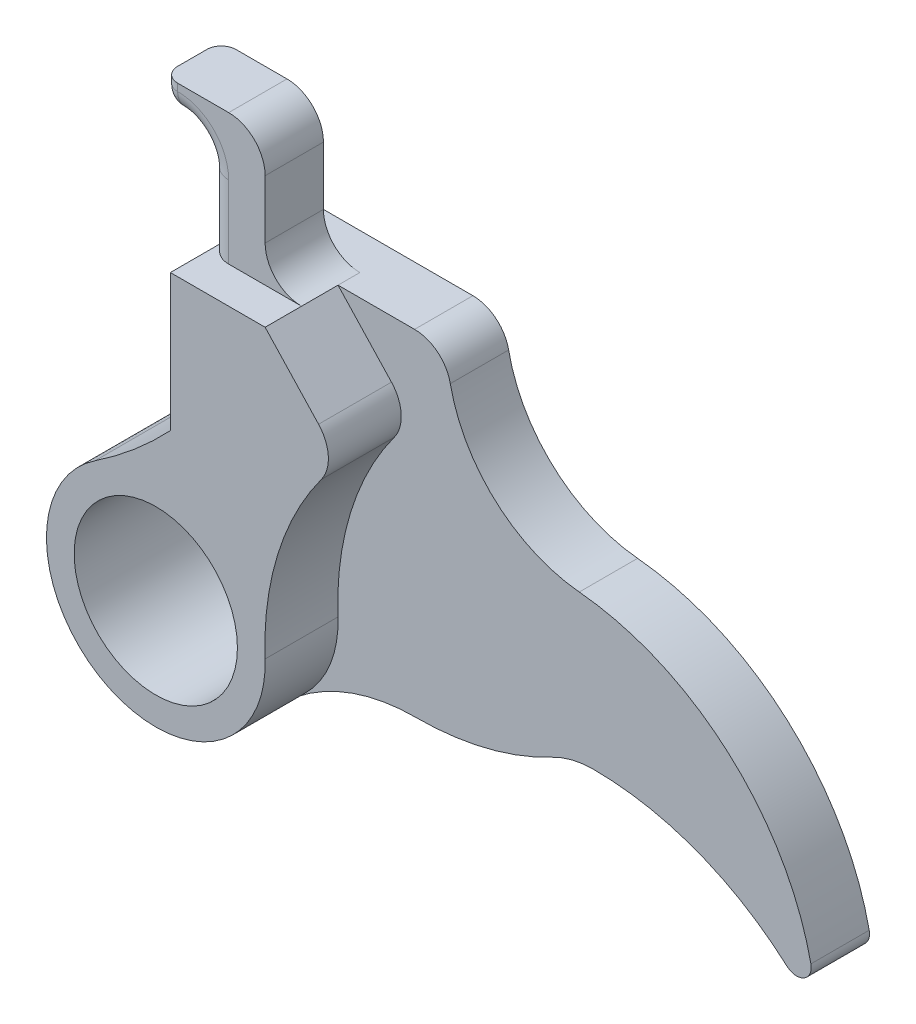
ISO-10303-21;
HEADER;
FILE_DESCRIPTION(('STEP AP214'),'2;1');
FILE_NAME('part.step','',(''),(''),'','','');
FILE_SCHEMA(('AUTOMOTIVE_DESIGN { 1 0 10303 214 1 1 1 1 }'));
ENDSEC;
DATA;
#1=APPLICATION_CONTEXT('core data for automotive mechanical design processes');
#2=APPLICATION_PROTOCOL_DEFINITION('international standard','automotive_design',2000,#1);
#3=PRODUCT_CONTEXT('',#1,'mechanical');
#4=PRODUCT('Part','Part','',(#3));
#5=PRODUCT_RELATED_PRODUCT_CATEGORY('part','',(#4));
#6=PRODUCT_DEFINITION_FORMATION('','',#4);
#7=PRODUCT_DEFINITION_CONTEXT('part definition',#1,'design');
#8=PRODUCT_DEFINITION('design','',#6,#7);
#9=PRODUCT_DEFINITION_SHAPE('','',#8);
#10=(LENGTH_UNIT() NAMED_UNIT(*) SI_UNIT(.MILLI.,.METRE.));
#11=(NAMED_UNIT(*) PLANE_ANGLE_UNIT() SI_UNIT($,.RADIAN.));
#12=(NAMED_UNIT(*) SI_UNIT($,.STERADIAN.) SOLID_ANGLE_UNIT());
#13=UNCERTAINTY_MEASURE_WITH_UNIT(LENGTH_MEASURE(1.E-05),#10,'distance_accuracy_value','');
#14=(GEOMETRIC_REPRESENTATION_CONTEXT(3) GLOBAL_UNCERTAINTY_ASSIGNED_CONTEXT((#13)) GLOBAL_UNIT_ASSIGNED_CONTEXT((#10,
#11,#12)) REPRESENTATION_CONTEXT('',''));
#15=CARTESIAN_POINT('',(0.,0.,0.));
#16=DIRECTION('',(0.,0.,1.));
#17=DIRECTION('',(1.,0.,0.));
#18=AXIS2_PLACEMENT_3D('',#15,#16,#17);
#19=CARTESIAN_POINT('',(0.,0.,9.));
#20=DIRECTION('',(0.,0.,1.));
#21=DIRECTION('',(1.,0.,0.));
#22=AXIS2_PLACEMENT_3D('',#19,#20,#21);
#23=PLANE('',#22);
#24=CARTESIAN_POINT('',(-25.,-20.,9.));
#25=DIRECTION('',(0.,0.,1.));
#26=DIRECTION('',(1.,0.,0.));
#27=AXIS2_PLACEMENT_3D('',#24,#25,#26);
#28=CIRCLE('',#27,5.6);
#29=CARTESIAN_POINT('',(-19.4,-20.,9.));
#30=VERTEX_POINT('',#29);
#31=EDGE_CURVE('E404',#30,#30,#28,.T.);
#32=ORIENTED_EDGE('',*,*,#31,.F.);
#33=EDGE_LOOP('',(#32));
#34=FACE_BOUND('',#33,.T.);
#35=CARTESIAN_POINT('',(2.47970711627112,-18.9437345011985,9.));
#36=DIRECTION('',(0.,0.,1.));
#37=DIRECTION('',(1.,0.,0.));
#38=AXIS2_PLACEMENT_3D('',#35,#36,#37);
#39=CIRCLE('',#38,20.);
#40=CARTESIAN_POINT('',(-13.6463406152361,-7.1136633027166,9.));
#41=VERTEX_POINT('',#40);
#42=CARTESIAN_POINT('',(-17.5055344228351,-19.711927591236,9.));
#43=VERTEX_POINT('',#42);
#44=EDGE_CURVE('E423',#41,#43,#39,.T.);
#45=ORIENTED_EDGE('',*,*,#44,.F.);
#46=CARTESIAN_POINT('',(-15.6620965816745,-5.63490440290636,9.));
#47=DIRECTION('',(0.,0.,1.));
#48=DIRECTION('',(1.,0.,0.));
#49=AXIS2_PLACEMENT_3D('',#46,#47,#48);
#50=CIRCLE('',#49,2.5);
#51=CARTESIAN_POINT('',(-13.8340809859854,-3.92951325073119,9.));
#52=VERTEX_POINT('',#51);
#53=EDGE_CURVE('E47',#41,#52,#50,.T.);
#54=ORIENTED_EDGE('',*,*,#53,.T.);
#55=DIRECTION('',(-0.682156460870068,0.731206238275648,0.));
#56=VECTOR('',#55,1.);
#57=CARTESIAN_POINT('',(-9.35659485063142,-8.72894854419405,9.));
#58=LINE('',#57,#56);
#59=CARTESIAN_POINT('',(-17.5,0.,9.));
#60=VERTEX_POINT('',#59);
#61=EDGE_CURVE('E236',#52,#60,#58,.T.);
#62=ORIENTED_EDGE('',*,*,#61,.T.);
#63=DIRECTION('',(1.,0.,0.));
#64=VECTOR('',#63,1.);
#65=CARTESIAN_POINT('',(0.,0.,9.));
#66=LINE('',#65,#64);
#67=CARTESIAN_POINT('',(-24.,0.,9.));
#68=VERTEX_POINT('',#67);
#69=EDGE_CURVE('E240',#68,#60,#66,.T.);
#70=ORIENTED_EDGE('',*,*,#69,.F.);
#71=DIRECTION('',(0.,1.,0.));
#72=VECTOR('',#71,1.);
#73=CARTESIAN_POINT('',(-24.,0.,9.));
#74=LINE('',#73,#72);
#75=CARTESIAN_POINT('',(-24.,-9.39099248921224,9.));
#76=VERTEX_POINT('',#75);
#77=EDGE_CURVE('E444',#76,#68,#74,.T.);
#78=ORIENTED_EDGE('',*,*,#77,.F.);
#79=CARTESIAN_POINT('',(-45.8407588151391,11.1755155852987,9.));
#80=DIRECTION('',(0.,0.,1.));
#81=DIRECTION('',(1.,0.,0.));
#82=AXIS2_PLACEMENT_3D('',#79,#80,#81);
#83=CIRCLE('',#82,30.);
#84=CARTESIAN_POINT('',(-29.1681517630278,-13.7648968829403,9.));
#85=VERTEX_POINT('',#84);
#86=EDGE_CURVE('E447',#85,#76,#83,.T.);
#87=ORIENTED_EDGE('',*,*,#86,.F.);
#88=CARTESIAN_POINT('',(-25.,-20.,9.));
#89=DIRECTION('',(0.,0.,1.));
#90=DIRECTION('',(1.,0.,0.));
#91=AXIS2_PLACEMENT_3D('',#88,#89,#90);
#92=CIRCLE('',#91,7.5);
#93=CARTESIAN_POINT('',(-20.3155700843968,-25.8571423378472,9.));
#94=VERTEX_POINT('',#93);
#95=EDGE_CURVE('E441',#85,#94,#92,.T.);
#96=ORIENTED_EDGE('',*,*,#95,.T.);
#97=CARTESIAN_POINT('',(-25.,-20.,9.));
#98=DIRECTION('',(0.,0.,1.));
#99=DIRECTION('',(1.,0.,0.));
#100=AXIS2_PLACEMENT_3D('',#97,#98,#99);
#101=CIRCLE('',#100,7.5);
#102=EDGE_CURVE('E276',#94,#43,#101,.T.);
#103=ORIENTED_EDGE('',*,*,#102,.T.);
#104=EDGE_LOOP('',(#45,#54,#62,#70,#78,#87,#96,#103));
#105=FACE_BOUND('',#104,.T.);
#106=ADVANCED_FACE('F39',(#34,#105),#23,.T.);
#107=CARTESIAN_POINT('',(2.47970711627112,-18.9437345011985,4.));
#108=DIRECTION('',(0.,0.,1.));
#109=DIRECTION('',(1.,0.,0.));
#110=AXIS2_PLACEMENT_3D('',#107,#108,#109);
#111=CYLINDRICAL_SURFACE('',#110,20.);
#112=CARTESIAN_POINT('',(2.47970711627112,-18.9437345011985,4.));
#113=DIRECTION('',(0.,0.,1.));
#114=DIRECTION('',(1.,0.,0.));
#115=AXIS2_PLACEMENT_3D('',#112,#113,#114);
#116=CIRCLE('',#115,20.);
#117=CARTESIAN_POINT('',(-13.6463406152361,-7.1136633027166,4.));
#118=VERTEX_POINT('',#117);
#119=CARTESIAN_POINT('',(-17.5055344228351,-19.711927591236,4.));
#120=VERTEX_POINT('',#119);
#121=EDGE_CURVE('E426',#118,#120,#116,.T.);
#122=ORIENTED_EDGE('',*,*,#121,.F.);
#123=DIRECTION('',(0.,0.,1.));
#124=VECTOR('',#123,1.);
#125=CARTESIAN_POINT('',(-13.6463406152361,-7.1136633027166,4.));
#126=LINE('',#125,#124);
#127=EDGE_CURVE('E54',#118,#41,#126,.T.);
#128=ORIENTED_EDGE('',*,*,#127,.T.);
#129=ORIENTED_EDGE('',*,*,#44,.T.);
#130=DIRECTION('',(0.,0.,1.));
#131=VECTOR('',#130,1.);
#132=CARTESIAN_POINT('',(-17.5055344228351,-19.711927591236,4.));
#133=LINE('',#132,#131);
#134=EDGE_CURVE('E279',#43,#120,#133,.F.);
#135=ORIENTED_EDGE('',*,*,#134,.T.);
#136=EDGE_LOOP('',(#122,#128,#129,#135));
#137=FACE_BOUND('',#136,.T.);
#138=ADVANCED_FACE('F550',(#137),#111,.F.);
#139=CARTESIAN_POINT('',(15.3208888623795,0.,0.));
#140=DIRECTION('',(0.,-1.,0.));
#141=DIRECTION('',(0.,0.,-1.));
#142=AXIS2_PLACEMENT_3D('',#139,#140,#141);
#143=PLANE('',#142);
#144=DIRECTION('',(0.,0.,-1.));
#145=VECTOR('',#144,1.);
#146=CARTESIAN_POINT('',(-17.5,0.,14.));
#147=LINE('',#146,#145);
#148=CARTESIAN_POINT('',(-17.5,0.,6.5));
#149=VERTEX_POINT('',#148);
#150=EDGE_CURVE('E246',#60,#149,#147,.T.);
#151=ORIENTED_EDGE('',*,*,#150,.T.);
#152=DIRECTION('',(-1.,0.,0.));
#153=VECTOR('',#152,1.);
#154=CARTESIAN_POINT('',(15.3208888623795,0.,6.5));
#155=LINE('',#154,#153);
#156=CARTESIAN_POINT('',(-22.5,0.,6.5));
#157=VERTEX_POINT('',#156);
#158=EDGE_CURVE('E417',#149,#157,#155,.T.);
#159=ORIENTED_EDGE('',*,*,#158,.T.);
#160=CARTESIAN_POINT('',(-22.5,0.,5.));
#161=DIRECTION('',(0.,-1.,0.));
#162=DIRECTION('',(0.,0.,-1.));
#163=AXIS2_PLACEMENT_3D('',#160,#161,#162);
#164=CIRCLE('',#163,1.5);
#165=CARTESIAN_POINT('',(-24.,0.,5.));
#166=VERTEX_POINT('',#165);
#167=EDGE_CURVE('E313',#157,#166,#164,.T.);
#168=ORIENTED_EDGE('',*,*,#167,.T.);
#169=DIRECTION('',(0.,0.,1.));
#170=VECTOR('',#169,1.);
#171=CARTESIAN_POINT('',(-24.,0.,9.));
#172=LINE('',#171,#170);
#173=EDGE_CURVE('E259',#166,#68,#172,.T.);
#174=ORIENTED_EDGE('',*,*,#173,.T.);
#175=ORIENTED_EDGE('',*,*,#69,.T.);
#176=EDGE_LOOP('',(#151,#159,#168,#174,#175));
#177=FACE_BOUND('',#176,.T.);
#178=ADVANCED_FACE('F257',(#177),#143,.F.);
#179=CARTESIAN_POINT('',(-12.1424843600049,-3.00956560725662,9.));
#180=DIRECTION('',(0.,0.,-1.));
#181=DIRECTION('',(-1.,0.,0.));
#182=AXIS2_PLACEMENT_3D('',#179,#180,#181);
#183=CYLINDRICAL_SURFACE('',#182,20.);
#184=DIRECTION('',(0.,0.,-1.));
#185=VECTOR('',#184,1.);
#186=CARTESIAN_POINT('',(-2.80211177538573,-20.6945151401361,9.));
#187=LINE('',#186,#185);
#188=CARTESIAN_POINT('',(-2.80211177538574,-20.6945151401361,4.));
#189=VERTEX_POINT('',#188);
#190=CARTESIAN_POINT('',(-2.80211177538573,-20.6945151401361,0.));
#191=VERTEX_POINT('',#190);
#192=EDGE_CURVE('E483',#189,#191,#187,.T.);
#193=ORIENTED_EDGE('',*,*,#192,.F.);
#194=CARTESIAN_POINT('',(-12.1424843600049,-3.00956560725662,4.));
#195=DIRECTION('',(0.,0.,1.));
#196=DIRECTION('',(1.,0.,0.));
#197=AXIS2_PLACEMENT_3D('',#194,#195,#196);
#198=CIRCLE('',#197,20.);
#199=CARTESIAN_POINT('',(-12.174852362437,-23.0095394150499,4.));
#200=VERTEX_POINT('',#199);
#201=EDGE_CURVE('E430',#200,#189,#198,.T.);
#202=ORIENTED_EDGE('',*,*,#201,.F.);
#203=DIRECTION('',(0.,0.,-1.));
#204=VECTOR('',#203,1.);
#205=CARTESIAN_POINT('',(-12.174852362437,-23.0095394150499,9.));
#206=LINE('',#205,#204);
#207=CARTESIAN_POINT('',(-12.174852362437,-23.0095394150499,0.));
#208=VERTEX_POINT('',#207);
#209=EDGE_CURVE('E485',#200,#208,#206,.T.);
#210=ORIENTED_EDGE('',*,*,#209,.T.);
#211=CARTESIAN_POINT('',(-12.1424843600049,-3.00956560725662,0.));
#212=DIRECTION('',(0.,0.,1.));
#213=DIRECTION('',(1.,0.,0.));
#214=AXIS2_PLACEMENT_3D('',#211,#212,#213);
#215=CIRCLE('',#214,20.);
#216=EDGE_CURVE('E456',#191,#208,#215,.F.);
#217=ORIENTED_EDGE('',*,*,#216,.F.);
#218=EDGE_LOOP('',(#193,#202,#210,#217));
#219=FACE_BOUND('',#218,.T.);
#220=ADVANCED_FACE('F546',(#219),#183,.T.);
#221=CARTESIAN_POINT('',(0.,-26.,9.));
#222=DIRECTION('',(0.,0.,-1.));
#223=DIRECTION('',(-1.,0.,0.));
#224=AXIS2_PLACEMENT_3D('',#221,#222,#223);
#225=CYLINDRICAL_SURFACE('',#224,6.);
#226=CARTESIAN_POINT('',(0.,-26.,4.));
#227=DIRECTION('',(0.,0.,-1.));
#228=DIRECTION('',(1.,0.,0.));
#229=AXIS2_PLACEMENT_3D('',#226,#227,#228);
#230=CIRCLE('',#229,6.);
#231=CARTESIAN_POINT('',(0.,-20.,4.));
#232=VERTEX_POINT('',#231);
#233=EDGE_CURVE('E432',#189,#232,#230,.T.);
#234=ORIENTED_EDGE('',*,*,#233,.F.);
#235=ORIENTED_EDGE('',*,*,#192,.T.);
#236=CARTESIAN_POINT('',(0.,-26.,0.));
#237=DIRECTION('',(0.,0.,1.));
#238=DIRECTION('',(1.,0.,0.));
#239=AXIS2_PLACEMENT_3D('',#236,#237,#238);
#240=CIRCLE('',#239,6.);
#241=CARTESIAN_POINT('',(0.,-20.,0.));
#242=VERTEX_POINT('',#241);
#243=EDGE_CURVE('E459',#191,#242,#240,.F.);
#244=ORIENTED_EDGE('',*,*,#243,.T.);
#245=DIRECTION('',(0.,0.,-1.));
#246=VECTOR('',#245,1.);
#247=CARTESIAN_POINT('',(0.,-20.,9.));
#248=LINE('',#247,#246);
#249=EDGE_CURVE('E480',#232,#242,#248,.T.);
#250=ORIENTED_EDGE('',*,*,#249,.F.);
#251=EDGE_LOOP('',(#234,#235,#244,#250));
#252=FACE_BOUND('',#251,.T.);
#253=ADVANCED_FACE('F543',(#252),#225,.F.);
#254=CARTESIAN_POINT('',(0.,-40.,9.));
#255=DIRECTION('',(0.,0.,-1.));
#256=DIRECTION('',(-1.,0.,0.));
#257=AXIS2_PLACEMENT_3D('',#254,#255,#256);
#258=CYLINDRICAL_SURFACE('',#257,20.);
#259=CARTESIAN_POINT('',(0.,-40.,0.));
#260=DIRECTION('',(0.,0.,1.));
#261=DIRECTION('',(1.,0.,0.));
#262=AXIS2_PLACEMENT_3D('',#259,#260,#261);
#263=CIRCLE('',#262,20.);
#264=CARTESIAN_POINT('',(13.2934445375952,-25.0572983592029,0.));
#265=VERTEX_POINT('',#264);
#266=EDGE_CURVE('E462',#265,#242,#263,.T.);
#267=ORIENTED_EDGE('',*,*,#266,.F.);
#268=DIRECTION('',(0.,0.,-1.));
#269=VECTOR('',#268,1.);
#270=CARTESIAN_POINT('',(13.2934445375952,-25.0572983592029,9.));
#271=LINE('',#270,#269);
#272=CARTESIAN_POINT('',(13.2934445375952,-25.0572983592029,4.));
#273=VERTEX_POINT('',#272);
#274=EDGE_CURVE('E272',#265,#273,#271,.F.);
#275=ORIENTED_EDGE('',*,*,#274,.T.);
#276=CARTESIAN_POINT('',(0.,-40.,4.));
#277=DIRECTION('',(0.,0.,-1.));
#278=DIRECTION('',(1.,0.,0.));
#279=AXIS2_PLACEMENT_3D('',#276,#277,#278);
#280=CIRCLE('',#279,20.);
#281=EDGE_CURVE('E434',#232,#273,#280,.T.);
#282=ORIENTED_EDGE('',*,*,#281,.F.);
#283=ORIENTED_EDGE('',*,*,#249,.T.);
#284=EDGE_LOOP('',(#267,#275,#282,#283));
#285=FACE_BOUND('',#284,.T.);
#286=ADVANCED_FACE('F536',(#285),#258,.F.);
#287=CARTESIAN_POINT('',(-2.6643549917152,-27.8729476819034,9.));
#288=DIRECTION('',(0.,0.,-1.));
#289=DIRECTION('',(-1.,0.,0.));
#290=AXIS2_PLACEMENT_3D('',#287,#288,#289);
#291=CYLINDRICAL_SURFACE('',#290,18.);
#292=CARTESIAN_POINT('',(-2.6643549917152,-27.8729476819034,4.));
#293=DIRECTION('',(0.,0.,1.));
#294=DIRECTION('',(1.,0.,0.));
#295=AXIS2_PLACEMENT_3D('',#292,#293,#294);
#296=CIRCLE('',#295,18.);
#297=CARTESIAN_POINT('',(14.9359092207214,-24.100587723943,4.));
#298=VERTEX_POINT('',#297);
#299=CARTESIAN_POINT('',(-0.95155535418399,-9.95462417210834,4.));
#300=VERTEX_POINT('',#299);
#301=EDGE_CURVE('E437',#298,#300,#296,.T.);
#302=ORIENTED_EDGE('',*,*,#301,.F.);
#303=DIRECTION('',(0.,0.,-1.));
#304=VECTOR('',#303,1.);
#305=CARTESIAN_POINT('',(14.9359092207214,-24.100587723943,9.));
#306=LINE('',#305,#304);
#307=CARTESIAN_POINT('',(14.9359092207214,-24.100587723943,0.));
#308=VERTEX_POINT('',#307);
#309=EDGE_CURVE('E260',#298,#308,#306,.T.);
#310=ORIENTED_EDGE('',*,*,#309,.T.);
#311=CARTESIAN_POINT('',(-2.6643549917152,-27.8729476819034,0.));
#312=DIRECTION('',(0.,0.,1.));
#313=DIRECTION('',(1.,0.,0.));
#314=AXIS2_PLACEMENT_3D('',#311,#312,#313);
#315=CIRCLE('',#314,18.);
#316=CARTESIAN_POINT('',(-0.951555354183998,-9.95462417210834,0.));
#317=VERTEX_POINT('',#316);
#318=EDGE_CURVE('E464',#308,#317,#315,.T.);
#319=ORIENTED_EDGE('',*,*,#318,.T.);
#320=DIRECTION('',(0.,0.,-1.));
#321=VECTOR('',#320,1.);
#322=CARTESIAN_POINT('',(-0.951555354183998,-9.95462417210834,9.));
#323=LINE('',#322,#321);
#324=EDGE_CURVE('E477',#300,#317,#323,.T.);
#325=ORIENTED_EDGE('',*,*,#324,.F.);
#326=EDGE_LOOP('',(#302,#310,#319,#325));
#327=FACE_BOUND('',#326,.T.);
#328=ADVANCED_FACE('F530',(#327),#291,.T.);
#329=CARTESIAN_POINT('',(-25.,-20.,9.));
#330=DIRECTION('',(0.,0.,-1.));
#331=DIRECTION('',(-1.,0.,0.));
#332=AXIS2_PLACEMENT_3D('',#329,#330,#331);
#333=CYLINDRICAL_SURFACE('',#332,7.5);
#334=CARTESIAN_POINT('',(-25.,-20.,0.));
#335=DIRECTION('',(0.,0.,1.));
#336=DIRECTION('',(1.,0.,0.));
#337=AXIS2_PLACEMENT_3D('',#334,#335,#336);
#338=CIRCLE('',#337,7.5);
#339=CARTESIAN_POINT('',(-29.1681517630278,-13.7648968829403,0.));
#340=VERTEX_POINT('',#339);
#341=CARTESIAN_POINT('',(-20.3155700843968,-25.8571423378472,0.));
#342=VERTEX_POINT('',#341);
#343=EDGE_CURVE('E439',#340,#342,#338,.T.);
#344=ORIENTED_EDGE('',*,*,#343,.T.);
#345=DIRECTION('',(0.,0.,-1.));
#346=VECTOR('',#345,1.);
#347=CARTESIAN_POINT('',(-20.3155700843968,-25.8571423378472,9.));
#348=LINE('',#347,#346);
#349=CARTESIAN_POINT('',(-20.3155700843968,-25.8571423378472,4.));
#350=VERTEX_POINT('',#349);
#351=EDGE_CURVE('E486',#350,#342,#348,.T.);
#352=ORIENTED_EDGE('',*,*,#351,.F.);
#353=EDGE_CURVE('E267',#94,#350,#348,.T.);
#354=ORIENTED_EDGE('',*,*,#353,.F.);
#355=ORIENTED_EDGE('',*,*,#95,.F.);
#356=DIRECTION('',(0.,0.,-1.));
#357=VECTOR('',#356,1.);
#358=CARTESIAN_POINT('',(-29.1681517630278,-13.7648968829403,9.));
#359=LINE('',#358,#357);
#360=EDGE_CURVE('E450',#85,#340,#359,.T.);
#361=ORIENTED_EDGE('',*,*,#360,.T.);
#362=EDGE_LOOP('',(#344,#352,#354,#355,#361));
#363=FACE_BOUND('',#362,.T.);
#364=ADVANCED_FACE('F503',(#363),#333,.T.);
#365=CARTESIAN_POINT('',(-12.1958915640179,-36.0095223901156,9.));
#366=DIRECTION('',(0.,0.,-1.));
#367=DIRECTION('',(-1.,0.,0.));
#368=AXIS2_PLACEMENT_3D('',#365,#366,#367);
#369=CYLINDRICAL_SURFACE('',#368,13.);
#370=CARTESIAN_POINT('',(-12.1958915640179,-36.0095223901156,4.));
#371=DIRECTION('',(0.,0.,-1.));
#372=DIRECTION('',(1.,0.,0.));
#373=AXIS2_PLACEMENT_3D('',#370,#371,#372);
#374=CIRCLE('',#373,13.);
#375=EDGE_CURVE('E428',#350,#200,#374,.T.);
#376=ORIENTED_EDGE('',*,*,#375,.F.);
#377=ORIENTED_EDGE('',*,*,#351,.T.);
#378=CARTESIAN_POINT('',(-12.1958915640179,-36.0095223901156,0.));
#379=DIRECTION('',(0.,0.,1.));
#380=DIRECTION('',(1.,0.,0.));
#381=AXIS2_PLACEMENT_3D('',#378,#379,#380);
#382=CIRCLE('',#381,13.);
#383=EDGE_CURVE('E453',#342,#208,#382,.F.);
#384=ORIENTED_EDGE('',*,*,#383,.T.);
#385=ORIENTED_EDGE('',*,*,#209,.F.);
#386=EDGE_LOOP('',(#376,#377,#384,#385));
#387=FACE_BOUND('',#386,.T.);
#388=ADVANCED_FACE('F494',(#387),#369,.F.);
#389=CARTESIAN_POINT('',(0.,0.,9.));
#390=DIRECTION('',(0.,0.,-1.));
#391=DIRECTION('',(-1.,0.,0.));
#392=AXIS2_PLACEMENT_3D('',#389,#390,#391);
#393=CYLINDRICAL_SURFACE('',#392,10.);
#394=CARTESIAN_POINT('',(0.,0.,0.));
#395=DIRECTION('',(0.,0.,1.));
#396=DIRECTION('',(1.,0.,0.));
#397=AXIS2_PLACEMENT_3D('',#394,#395,#396);
#398=CIRCLE('',#397,10.);
#399=CARTESIAN_POINT('',(-9.79795897113271,-2.,0.));
#400=VERTEX_POINT('',#399);
#401=EDGE_CURVE('E466',#317,#400,#398,.F.);
#402=ORIENTED_EDGE('',*,*,#401,.T.);
#403=DIRECTION('',(0.,0.,-1.));
#404=VECTOR('',#403,1.);
#405=CARTESIAN_POINT('',(-9.79795897113271,-2.,9.));
#406=LINE('',#405,#404);
#407=CARTESIAN_POINT('',(-9.79795897113271,-2.,4.));
#408=VERTEX_POINT('',#407);
#409=EDGE_CURVE('E383',#400,#408,#406,.F.);
#410=ORIENTED_EDGE('',*,*,#409,.T.);
#411=CARTESIAN_POINT('',(0.,0.,4.));
#412=DIRECTION('',(0.,0.,-1.));
#413=DIRECTION('',(1.,0.,0.));
#414=AXIS2_PLACEMENT_3D('',#411,#412,#413);
#415=CIRCLE('',#414,10.);
#416=EDGE_CURVE('E424',#300,#408,#415,.T.);
#417=ORIENTED_EDGE('',*,*,#416,.F.);
#418=ORIENTED_EDGE('',*,*,#324,.T.);
#419=EDGE_LOOP('',(#402,#410,#417,#418));
#420=FACE_BOUND('',#419,.T.);
#421=ADVANCED_FACE('F525',(#420),#393,.F.);
#422=CARTESIAN_POINT('',(-24.,0.,9.));
#423=DIRECTION('',(-1.,0.,0.));
#424=DIRECTION('',(0.,0.,1.));
#425=AXIS2_PLACEMENT_3D('',#422,#423,#424);
#426=PLANE('',#425);
#427=DIRECTION('',(0.,0.,-1.));
#428=VECTOR('',#427,1.);
#429=CARTESIAN_POINT('',(-24.,5.,2.5));
#430=LINE('',#429,#428);
#431=CARTESIAN_POINT('',(-24.,5.,5.));
#432=VERTEX_POINT('',#431);
#433=CARTESIAN_POINT('',(-24.,5.,4.));
#434=VERTEX_POINT('',#433);
#435=EDGE_CURVE('E285',#432,#434,#430,.T.);
#436=ORIENTED_EDGE('',*,*,#435,.T.);
#437=DIRECTION('',(0.,1.,0.));
#438=VECTOR('',#437,1.);
#439=CARTESIAN_POINT('',(-24.,0.,4.));
#440=LINE('',#439,#438);
#441=CARTESIAN_POINT('',(-24.,0.,4.));
#442=VERTEX_POINT('',#441);
#443=EDGE_CURVE('E298',#434,#442,#440,.F.);
#444=ORIENTED_EDGE('',*,*,#443,.T.);
#445=DIRECTION('',(0.,0.,1.));
#446=VECTOR('',#445,1.);
#447=CARTESIAN_POINT('',(-24.,0.,0.));
#448=LINE('',#447,#446);
#449=CARTESIAN_POINT('',(-24.,0.,0.));
#450=VERTEX_POINT('',#449);
#451=EDGE_CURVE('E419',#450,#442,#448,.T.);
#452=ORIENTED_EDGE('',*,*,#451,.F.);
#453=DIRECTION('',(0.,1.,0.));
#454=VECTOR('',#453,1.);
#455=CARTESIAN_POINT('',(-24.,0.,0.));
#456=LINE('',#455,#454);
#457=CARTESIAN_POINT('',(-24.,-9.39099248921224,0.));
#458=VERTEX_POINT('',#457);
#459=EDGE_CURVE('E469',#458,#450,#456,.T.);
#460=ORIENTED_EDGE('',*,*,#459,.F.);
#461=DIRECTION('',(0.,0.,-1.));
#462=VECTOR('',#461,1.);
#463=CARTESIAN_POINT('',(-24.,-9.39099248921224,9.));
#464=LINE('',#463,#462);
#465=EDGE_CURVE('E475',#76,#458,#464,.T.);
#466=ORIENTED_EDGE('',*,*,#465,.F.);
#467=ORIENTED_EDGE('',*,*,#77,.T.);
#468=ORIENTED_EDGE('',*,*,#173,.F.);
#469=DIRECTION('',(0.,-1.,0.));
#470=VECTOR('',#469,1.);
#471=CARTESIAN_POINT('',(-24.,5.,5.));
#472=LINE('',#471,#470);
#473=EDGE_CURVE('E296',#166,#432,#472,.F.);
#474=ORIENTED_EDGE('',*,*,#473,.T.);
#475=EDGE_LOOP('',(#436,#444,#452,#460,#466,#467,#468,#474));
#476=FACE_BOUND('',#475,.T.);
#477=ADVANCED_FACE('F511',(#476),#426,.T.);
#478=CARTESIAN_POINT('',(-45.8407588151391,11.1755155852987,9.));
#479=DIRECTION('',(0.,0.,-1.));
#480=DIRECTION('',(-1.,0.,0.));
#481=AXIS2_PLACEMENT_3D('',#478,#479,#480);
#482=CYLINDRICAL_SURFACE('',#481,30.);
#483=CARTESIAN_POINT('',(-45.8407588151391,11.1755155852987,0.));
#484=DIRECTION('',(0.,0.,1.));
#485=DIRECTION('',(1.,0.,0.));
#486=AXIS2_PLACEMENT_3D('',#483,#484,#485);
#487=CIRCLE('',#486,30.);
#488=EDGE_CURVE('E445',#340,#458,#487,.T.);
#489=ORIENTED_EDGE('',*,*,#488,.F.);
#490=ORIENTED_EDGE('',*,*,#360,.F.);
#491=ORIENTED_EDGE('',*,*,#86,.T.);
#492=ORIENTED_EDGE('',*,*,#465,.T.);
#493=EDGE_LOOP('',(#489,#490,#491,#492));
#494=FACE_BOUND('',#493,.T.);
#495=ADVANCED_FACE('F507',(#494),#482,.F.);
#496=CARTESIAN_POINT('',(0.,0.,0.));
#497=DIRECTION('',(0.,0.,1.));
#498=DIRECTION('',(1.,0.,0.));
#499=AXIS2_PLACEMENT_3D('',#496,#497,#498);
#500=PLANE('',#499);
#501=CARTESIAN_POINT('',(-25.,-20.,0.));
#502=DIRECTION('',(0.,0.,1.));
#503=DIRECTION('',(1.,0.,0.));
#504=AXIS2_PLACEMENT_3D('',#501,#502,#503);
#505=CIRCLE('',#504,5.6);
#506=CARTESIAN_POINT('',(-19.4,-20.,0.));
#507=VERTEX_POINT('',#506);
#508=EDGE_CURVE('E351',#507,#507,#505,.T.);
#509=ORIENTED_EDGE('',*,*,#508,.T.);
#510=EDGE_LOOP('',(#509));
#511=FACE_BOUND('',#510,.T.);
#512=DIRECTION('',(1.,0.,0.));
#513=VECTOR('',#512,1.);
#514=CARTESIAN_POINT('',(0.,0.,0.));
#515=LINE('',#514,#513);
#516=CARTESIAN_POINT('',(-12.2474487139159,0.,0.));
#517=VERTEX_POINT('',#516);
#518=EDGE_CURVE('E261',#450,#517,#515,.T.);
#519=ORIENTED_EDGE('',*,*,#518,.T.);
#520=CARTESIAN_POINT('',(-12.2474487139159,-2.5,0.));
#521=DIRECTION('',(0.,0.,1.));
#522=DIRECTION('',(1.,0.,0.));
#523=AXIS2_PLACEMENT_3D('',#520,#521,#522);
#524=CIRCLE('',#523,2.5);
#525=EDGE_CURVE('E381',#517,#400,#524,.F.);
#526=ORIENTED_EDGE('',*,*,#525,.T.);
#527=ORIENTED_EDGE('',*,*,#401,.F.);
#528=ORIENTED_EDGE('',*,*,#318,.F.);
#529=CARTESIAN_POINT('',(13.9581167644749,-24.310163277163,0.));
#530=DIRECTION('',(0.,0.,1.));
#531=DIRECTION('',(1.,0.,0.));
#532=AXIS2_PLACEMENT_3D('',#529,#530,#531);
#533=CIRCLE('',#532,1.);
#534=EDGE_CURVE('E264',#308,#265,#533,.F.);
#535=ORIENTED_EDGE('',*,*,#534,.T.);
#536=ORIENTED_EDGE('',*,*,#266,.T.);
#537=ORIENTED_EDGE('',*,*,#243,.F.);
#538=ORIENTED_EDGE('',*,*,#216,.T.);
#539=ORIENTED_EDGE('',*,*,#383,.F.);
#540=ORIENTED_EDGE('',*,*,#343,.F.);
#541=ORIENTED_EDGE('',*,*,#488,.T.);
#542=ORIENTED_EDGE('',*,*,#459,.T.);
#543=EDGE_LOOP('',(#519,#526,#527,#528,#535,#536,#537,#538,#539,#540,#541,#542));
#544=FACE_BOUND('',#543,.T.);
#545=ADVANCED_FACE('F499',(#511,#544),#500,.F.);
#546=CARTESIAN_POINT('',(-1.3321774958576,-13.9364738409517,4.));
#547=DIRECTION('',(0.,0.,1.));
#548=DIRECTION('',(1.,0.,0.));
#549=AXIS2_PLACEMENT_3D('',#546,#547,#548);
#550=PLANE('',#549);
#551=ORIENTED_EDGE('',*,*,#416,.T.);
#552=CARTESIAN_POINT('',(-12.2474487139159,-2.5,4.));
#553=DIRECTION('',(0.,0.,1.));
#554=DIRECTION('',(1.,0.,0.));
#555=AXIS2_PLACEMENT_3D('',#552,#553,#554);
#556=CIRCLE('',#555,2.5);
#557=CARTESIAN_POINT('',(-12.2474487139159,0.,4.));
#558=VERTEX_POINT('',#557);
#559=EDGE_CURVE('E385',#408,#558,#556,.T.);
#560=ORIENTED_EDGE('',*,*,#559,.T.);
#561=DIRECTION('',(-1.,0.,0.));
#562=VECTOR('',#561,1.);
#563=CARTESIAN_POINT('',(-17.5,0.,4.));
#564=LINE('',#563,#562);
#565=CARTESIAN_POINT('',(-17.5,0.,4.));
#566=VERTEX_POINT('',#565);
#567=EDGE_CURVE('E395',#558,#566,#564,.T.);
#568=ORIENTED_EDGE('',*,*,#567,.T.);
#569=DIRECTION('',(0.682156460870068,-0.731206238275648,0.));
#570=VECTOR('',#569,1.);
#571=CARTESIAN_POINT('',(-17.5,0.,4.));
#572=LINE('',#571,#570);
#573=CARTESIAN_POINT('',(-13.8340809859854,-3.92951325073119,4.));
#574=VERTEX_POINT('',#573);
#575=EDGE_CURVE('E255',#566,#574,#572,.T.);
#576=ORIENTED_EDGE('',*,*,#575,.T.);
#577=CARTESIAN_POINT('',(-15.6620965816745,-5.63490440290636,4.));
#578=DIRECTION('',(0.,0.,1.));
#579=DIRECTION('',(1.,0.,0.));
#580=AXIS2_PLACEMENT_3D('',#577,#578,#579);
#581=CIRCLE('',#580,2.5);
#582=EDGE_CURVE('E11',#574,#118,#581,.F.);
#583=ORIENTED_EDGE('',*,*,#582,.T.);
#584=ORIENTED_EDGE('',*,*,#121,.T.);
#585=CARTESIAN_POINT('',(-25.,-20.,4.));
#586=DIRECTION('',(0.,0.,1.));
#587=DIRECTION('',(1.,0.,0.));
#588=AXIS2_PLACEMENT_3D('',#585,#586,#587);
#589=CIRCLE('',#588,7.5);
#590=EDGE_CURVE('E282',#120,#350,#589,.F.);
#591=ORIENTED_EDGE('',*,*,#590,.T.);
#592=ORIENTED_EDGE('',*,*,#375,.T.);
#593=ORIENTED_EDGE('',*,*,#201,.T.);
#594=ORIENTED_EDGE('',*,*,#233,.T.);
#595=ORIENTED_EDGE('',*,*,#281,.T.);
#596=CARTESIAN_POINT('',(13.9581167644749,-24.310163277163,4.));
#597=DIRECTION('',(0.,0.,1.));
#598=DIRECTION('',(1.,0.,0.));
#599=AXIS2_PLACEMENT_3D('',#596,#597,#598);
#600=CIRCLE('',#599,1.);
#601=EDGE_CURVE('E274',#273,#298,#600,.T.);
#602=ORIENTED_EDGE('',*,*,#601,.T.);
#603=ORIENTED_EDGE('',*,*,#301,.T.);
#604=EDGE_LOOP('',(#551,#560,#568,#576,#583,#584,#591,#592,#593,#594,#595,#602,#603));
#605=FACE_BOUND('',#604,.T.);
#606=ADVANCED_FACE('F393',(#605),#550,.T.);
#607=CARTESIAN_POINT('',(15.3208888623795,7.,2.5));
#608=DIRECTION('',(0.,0.,1.));
#609=DIRECTION('',(0.,-1.,0.));
#610=AXIS2_PLACEMENT_3D('',#607,#608,#609);
#611=PLANE('',#610);
#612=DIRECTION('',(-1.,0.,0.));
#613=VECTOR('',#612,1.);
#614=CARTESIAN_POINT('',(-9.99999999999999,9.,2.5));
#615=LINE('',#614,#613);
#616=CARTESIAN_POINT('',(-22.5,9.,2.5));
#617=VERTEX_POINT('',#616);
#618=CARTESIAN_POINT('',(-26.,9.,2.5));
#619=VERTEX_POINT('',#618);
#620=EDGE_CURVE('E322',#617,#619,#615,.T.);
#621=ORIENTED_EDGE('',*,*,#620,.F.);
#622=CARTESIAN_POINT('',(-22.5,6.5,2.5));
#623=DIRECTION('',(0.,0.,1.));
#624=DIRECTION('',(0.,-1.,0.));
#625=AXIS2_PLACEMENT_3D('',#622,#623,#624);
#626=CIRCLE('',#625,2.5);
#627=CARTESIAN_POINT('',(-20.,6.5,2.5));
#628=VERTEX_POINT('',#627);
#629=EDGE_CURVE('E371',#617,#628,#626,.F.);
#630=ORIENTED_EDGE('',*,*,#629,.T.);
#631=DIRECTION('',(0.,-1.,0.));
#632=VECTOR('',#631,1.);
#633=CARTESIAN_POINT('',(-20.,7.,2.5));
#634=LINE('',#633,#632);
#635=CARTESIAN_POINT('',(-20.,2.5,2.5));
#636=VERTEX_POINT('',#635);
#637=EDGE_CURVE('E401',#628,#636,#634,.T.);
#638=ORIENTED_EDGE('',*,*,#637,.T.);
#639=CARTESIAN_POINT('',(-17.5,2.5,2.5));
#640=DIRECTION('',(0.,0.,1.));
#641=DIRECTION('',(0.,-1.,0.));
#642=AXIS2_PLACEMENT_3D('',#639,#640,#641);
#643=CIRCLE('',#642,2.5);
#644=CARTESIAN_POINT('',(-17.5,0.,2.5));
#645=VERTEX_POINT('',#644);
#646=EDGE_CURVE('E375',#636,#645,#643,.T.);
#647=ORIENTED_EDGE('',*,*,#646,.T.);
#648=DIRECTION('',(-1.,0.,0.));
#649=VECTOR('',#648,1.);
#650=CARTESIAN_POINT('',(15.3208888623795,0.,2.5));
#651=LINE('',#650,#649);
#652=CARTESIAN_POINT('',(-22.5,0.,2.5));
#653=VERTEX_POINT('',#652);
#654=EDGE_CURVE('E421',#645,#653,#651,.T.);
#655=ORIENTED_EDGE('',*,*,#654,.T.);
#656=DIRECTION('',(0.,1.,0.));
#657=VECTOR('',#656,1.);
#658=CARTESIAN_POINT('',(-22.5,5.,2.5));
#659=LINE('',#658,#657);
#660=CARTESIAN_POINT('',(-22.5,5.,2.5));
#661=VERTEX_POINT('',#660);
#662=EDGE_CURVE('E293',#653,#661,#659,.T.);
#663=ORIENTED_EDGE('',*,*,#662,.T.);
#664=CARTESIAN_POINT('',(-26.,5.,2.5));
#665=DIRECTION('',(0.,0.,1.));
#666=DIRECTION('',(0.,-1.,0.));
#667=AXIS2_PLACEMENT_3D('',#664,#665,#666);
#668=CIRCLE('',#667,3.5);
#669=CARTESIAN_POINT('',(-26.,8.5,2.5));
#670=VERTEX_POINT('',#669);
#671=EDGE_CURVE('E291',#661,#670,#668,.T.);
#672=ORIENTED_EDGE('',*,*,#671,.T.);
#673=DIRECTION('',(0.,-1.,0.));
#674=VECTOR('',#673,1.);
#675=CARTESIAN_POINT('',(-26.,7.,2.5));
#676=LINE('',#675,#674);
#677=EDGE_CURVE('E339',#670,#619,#676,.F.);
#678=ORIENTED_EDGE('',*,*,#677,.T.);
#679=EDGE_LOOP('',(#621,#630,#638,#647,#655,#663,#672,#678));
#680=FACE_BOUND('',#679,.T.);
#681=ADVANCED_FACE('F578',(#680),#611,.F.);
#682=ORIENTED_EDGE('',*,*,#567,.F.);
#683=DIRECTION('',(0.,0.,-1.));
#684=VECTOR('',#683,1.);
#685=CARTESIAN_POINT('',(-12.2474487139159,0.,0.));
#686=LINE('',#685,#684);
#687=EDGE_CURVE('E378',#558,#517,#686,.T.);
#688=ORIENTED_EDGE('',*,*,#687,.T.);
#689=ORIENTED_EDGE('',*,*,#518,.F.);
#690=ORIENTED_EDGE('',*,*,#451,.T.);
#691=CARTESIAN_POINT('',(-22.5,0.,4.));
#692=DIRECTION('',(0.,-1.,0.));
#693=DIRECTION('',(0.,0.,-1.));
#694=AXIS2_PLACEMENT_3D('',#691,#692,#693);
#695=CIRCLE('',#694,1.5);
#696=EDGE_CURVE('E310',#442,#653,#695,.T.);
#697=ORIENTED_EDGE('',*,*,#696,.T.);
#698=ORIENTED_EDGE('',*,*,#654,.F.);
#699=DIRECTION('',(0.,0.,1.));
#700=VECTOR('',#699,1.);
#701=CARTESIAN_POINT('',(-17.5,0.,6.5));
#702=LINE('',#701,#700);
#703=EDGE_CURVE('E359',#645,#566,#702,.T.);
#704=ORIENTED_EDGE('',*,*,#703,.T.);
#705=EDGE_LOOP('',(#682,#688,#689,#690,#697,#698,#704));
#706=FACE_BOUND('',#705,.T.);
#707=ADVANCED_FACE('F515',(#706),#143,.F.);
#708=CARTESIAN_POINT('',(15.3208888623795,7.,6.5));
#709=DIRECTION('',(0.,0.,-1.));
#710=DIRECTION('',(0.,1.,0.));
#711=AXIS2_PLACEMENT_3D('',#708,#709,#710);
#712=PLANE('',#711);
#713=DIRECTION('',(0.,-1.,0.));
#714=VECTOR('',#713,1.);
#715=CARTESIAN_POINT('',(-20.,9.,6.5));
#716=LINE('',#715,#714);
#717=CARTESIAN_POINT('',(-20.,6.5,6.5));
#718=VERTEX_POINT('',#717);
#719=CARTESIAN_POINT('',(-20.,2.5,6.5));
#720=VERTEX_POINT('',#719);
#721=EDGE_CURVE('E245',#718,#720,#716,.T.);
#722=ORIENTED_EDGE('',*,*,#721,.F.);
#723=CARTESIAN_POINT('',(-22.5,6.5,6.5));
#724=DIRECTION('',(0.,0.,-1.));
#725=DIRECTION('',(0.,1.,0.));
#726=AXIS2_PLACEMENT_3D('',#723,#724,#725);
#727=CIRCLE('',#726,2.5);
#728=CARTESIAN_POINT('',(-22.5,9.,6.5));
#729=VERTEX_POINT('',#728);
#730=EDGE_CURVE('E367',#718,#729,#727,.F.);
#731=ORIENTED_EDGE('',*,*,#730,.T.);
#732=DIRECTION('',(1.,0.,0.));
#733=VECTOR('',#732,1.);
#734=CARTESIAN_POINT('',(-9.99999999999999,9.,6.5));
#735=LINE('',#734,#733);
#736=CARTESIAN_POINT('',(-26.,9.,6.5));
#737=VERTEX_POINT('',#736);
#738=EDGE_CURVE('E413',#737,#729,#735,.T.);
#739=ORIENTED_EDGE('',*,*,#738,.F.);
#740=DIRECTION('',(0.,-1.,0.));
#741=VECTOR('',#740,1.);
#742=CARTESIAN_POINT('',(-26.,7.,6.5));
#743=LINE('',#742,#741);
#744=CARTESIAN_POINT('',(-26.,8.5,6.5));
#745=VERTEX_POINT('',#744);
#746=EDGE_CURVE('E346',#737,#745,#743,.T.);
#747=ORIENTED_EDGE('',*,*,#746,.T.);
#748=CARTESIAN_POINT('',(-26.,5.,6.5));
#749=DIRECTION('',(0.,0.,-1.));
#750=DIRECTION('',(0.,1.,0.));
#751=AXIS2_PLACEMENT_3D('',#748,#749,#750);
#752=CIRCLE('',#751,3.5);
#753=CARTESIAN_POINT('',(-22.5,5.,6.5));
#754=VERTEX_POINT('',#753);
#755=EDGE_CURVE('E301',#745,#754,#752,.T.);
#756=ORIENTED_EDGE('',*,*,#755,.T.);
#757=DIRECTION('',(0.,-1.,0.));
#758=VECTOR('',#757,1.);
#759=CARTESIAN_POINT('',(-22.5,0.,6.5));
#760=LINE('',#759,#758);
#761=EDGE_CURVE('E303',#754,#157,#760,.T.);
#762=ORIENTED_EDGE('',*,*,#761,.T.);
#763=ORIENTED_EDGE('',*,*,#158,.F.);
#764=CARTESIAN_POINT('',(-17.5,2.5,6.5));
#765=DIRECTION('',(0.,0.,-1.));
#766=DIRECTION('',(0.,1.,0.));
#767=AXIS2_PLACEMENT_3D('',#764,#765,#766);
#768=CIRCLE('',#767,2.5);
#769=EDGE_CURVE('E373',#149,#720,#768,.T.);
#770=ORIENTED_EDGE('',*,*,#769,.T.);
#771=EDGE_LOOP('',(#722,#731,#739,#747,#756,#762,#763,#770));
#772=FACE_BOUND('',#771,.T.);
#773=ADVANCED_FACE('F587',(#772),#712,.F.);
#774=CARTESIAN_POINT('',(13.9581167644749,-24.310163277163,9.));
#775=DIRECTION('',(0.,0.,1.));
#776=DIRECTION('',(1.,0.,0.));
#777=AXIS2_PLACEMENT_3D('',#774,#775,#776);
#778=CYLINDRICAL_SURFACE('',#777,1.);
#779=ORIENTED_EDGE('',*,*,#601,.F.);
#780=ORIENTED_EDGE('',*,*,#274,.F.);
#781=ORIENTED_EDGE('',*,*,#534,.F.);
#782=ORIENTED_EDGE('',*,*,#309,.F.);
#783=EDGE_LOOP('',(#779,#780,#781,#782));
#784=FACE_BOUND('',#783,.T.);
#785=ADVANCED_FACE('F540',(#784),#778,.T.);
#786=CARTESIAN_POINT('',(-27.,9.,2.5));
#787=DIRECTION('',(1.,0.,0.));
#788=DIRECTION('',(0.,0.,-1.));
#789=AXIS2_PLACEMENT_3D('',#786,#787,#788);
#790=PLANE('',#789);
#791=DIRECTION('',(0.,0.,1.));
#792=VECTOR('',#791,1.);
#793=CARTESIAN_POINT('',(-27.,9.,2.5));
#794=LINE('',#793,#792);
#795=CARTESIAN_POINT('',(-27.,9.,3.5));
#796=VERTEX_POINT('',#795);
#797=CARTESIAN_POINT('',(-27.,9.,5.5));
#798=VERTEX_POINT('',#797);
#799=EDGE_CURVE('E410',#796,#798,#794,.T.);
#800=ORIENTED_EDGE('',*,*,#799,.F.);
#801=DIRECTION('',(0.,-1.,0.));
#802=VECTOR('',#801,1.);
#803=CARTESIAN_POINT('',(-27.,9.,3.5));
#804=LINE('',#803,#802);
#805=CARTESIAN_POINT('',(-27.,8.5,3.5));
#806=VERTEX_POINT('',#805);
#807=EDGE_CURVE('E336',#796,#806,#804,.T.);
#808=ORIENTED_EDGE('',*,*,#807,.T.);
#809=CARTESIAN_POINT('',(-27.,8.5,4.));
#810=DIRECTION('',(1.,0.,0.));
#811=DIRECTION('',(0.,0.,-1.));
#812=AXIS2_PLACEMENT_3D('',#809,#810,#811);
#813=CIRCLE('',#812,0.5);
#814=CARTESIAN_POINT('',(-27.,8.,4.));
#815=VERTEX_POINT('',#814);
#816=EDGE_CURVE('E334',#806,#815,#813,.F.);
#817=ORIENTED_EDGE('',*,*,#816,.T.);
#818=DIRECTION('',(0.,0.,1.));
#819=VECTOR('',#818,1.);
#820=CARTESIAN_POINT('',(-27.,8.,5.));
#821=LINE('',#820,#819);
#822=CARTESIAN_POINT('',(-27.,8.,5.));
#823=VERTEX_POINT('',#822);
#824=EDGE_CURVE('E332',#815,#823,#821,.T.);
#825=ORIENTED_EDGE('',*,*,#824,.T.);
#826=CARTESIAN_POINT('',(-27.,8.5,5.));
#827=DIRECTION('',(1.,0.,0.));
#828=DIRECTION('',(0.,0.,-1.));
#829=AXIS2_PLACEMENT_3D('',#826,#827,#828);
#830=CIRCLE('',#829,0.5);
#831=CARTESIAN_POINT('',(-27.,8.5,5.5));
#832=VERTEX_POINT('',#831);
#833=EDGE_CURVE('E315',#823,#832,#830,.F.);
#834=ORIENTED_EDGE('',*,*,#833,.T.);
#835=DIRECTION('',(0.,-1.,0.));
#836=VECTOR('',#835,1.);
#837=CARTESIAN_POINT('',(-27.,9.,5.5));
#838=LINE('',#837,#836);
#839=EDGE_CURVE('E330',#832,#798,#838,.F.);
#840=ORIENTED_EDGE('',*,*,#839,.T.);
#841=EDGE_LOOP('',(#800,#808,#817,#825,#834,#840));
#842=FACE_BOUND('',#841,.T.);
#843=ADVANCED_FACE('F621',(#842),#790,.F.);
#844=CARTESIAN_POINT('',(0.,9.,0.));
#845=DIRECTION('',(0.,-1.,0.));
#846=DIRECTION('',(0.,0.,-1.));
#847=AXIS2_PLACEMENT_3D('',#844,#845,#846);
#848=PLANE('',#847);
#849=ORIENTED_EDGE('',*,*,#738,.T.);
#850=DIRECTION('',(0.,0.,1.));
#851=VECTOR('',#850,1.);
#852=CARTESIAN_POINT('',(-22.5,9.,0.));
#853=LINE('',#852,#851);
#854=EDGE_CURVE('E369',#729,#617,#853,.F.);
#855=ORIENTED_EDGE('',*,*,#854,.T.);
#856=ORIENTED_EDGE('',*,*,#620,.T.);
#857=CARTESIAN_POINT('',(-26.,9.,3.5));
#858=DIRECTION('',(0.,-1.,0.));
#859=DIRECTION('',(0.,0.,-1.));
#860=AXIS2_PLACEMENT_3D('',#857,#858,#859);
#861=CIRCLE('',#860,1.);
#862=EDGE_CURVE('E344',#619,#796,#861,.F.);
#863=ORIENTED_EDGE('',*,*,#862,.T.);
#864=ORIENTED_EDGE('',*,*,#799,.T.);
#865=CARTESIAN_POINT('',(-26.,9.,5.5));
#866=DIRECTION('',(0.,-1.,0.));
#867=DIRECTION('',(0.,0.,-1.));
#868=AXIS2_PLACEMENT_3D('',#865,#866,#867);
#869=CIRCLE('',#868,1.);
#870=EDGE_CURVE('E342',#798,#737,#869,.F.);
#871=ORIENTED_EDGE('',*,*,#870,.T.);
#872=EDGE_LOOP('',(#849,#855,#856,#863,#864,#871));
#873=FACE_BOUND('',#872,.T.);
#874=ADVANCED_FACE('F599',(#873),#848,.F.);
#875=CARTESIAN_POINT('',(-25.,-20.,4.));
#876=DIRECTION('',(0.,0.,1.));
#877=DIRECTION('',(1.,0.,0.));
#878=AXIS2_PLACEMENT_3D('',#875,#876,#877);
#879=CYLINDRICAL_SURFACE('',#878,7.5);
#880=ORIENTED_EDGE('',*,*,#590,.F.);
#881=ORIENTED_EDGE('',*,*,#134,.F.);
#882=ORIENTED_EDGE('',*,*,#102,.F.);
#883=ORIENTED_EDGE('',*,*,#353,.T.);
#884=EDGE_LOOP('',(#880,#881,#882,#883));
#885=FACE_BOUND('',#884,.T.);
#886=ADVANCED_FACE('F549',(#885),#879,.T.);
#887=CARTESIAN_POINT('',(-26.,5.,9.));
#888=DIRECTION('',(0.,0.,1.));
#889=DIRECTION('',(1.,0.,0.));
#890=AXIS2_PLACEMENT_3D('',#887,#888,#889);
#891=CYLINDRICAL_SURFACE('',#890,2.);
#892=DIRECTION('',(0.,0.,-1.));
#893=VECTOR('',#892,1.);
#894=CARTESIAN_POINT('',(-26.,7.,6.5));
#895=LINE('',#894,#893);
#896=CARTESIAN_POINT('',(-26.,7.,4.));
#897=VERTEX_POINT('',#896);
#898=CARTESIAN_POINT('',(-26.,7.,5.));
#899=VERTEX_POINT('',#898);
#900=EDGE_CURVE('E288',#897,#899,#895,.F.);
#901=ORIENTED_EDGE('',*,*,#900,.F.);
#902=CARTESIAN_POINT('',(-26.,5.,4.));
#903=DIRECTION('',(0.,0.,1.));
#904=DIRECTION('',(0.,-1.,0.));
#905=AXIS2_PLACEMENT_3D('',#902,#903,#904);
#906=CIRCLE('',#905,2.);
#907=EDGE_CURVE('E308',#897,#434,#906,.F.);
#908=ORIENTED_EDGE('',*,*,#907,.T.);
#909=ORIENTED_EDGE('',*,*,#435,.F.);
#910=CARTESIAN_POINT('',(-26.,5.,5.));
#911=DIRECTION('',(0.,0.,-1.));
#912=DIRECTION('',(0.,1.,0.));
#913=AXIS2_PLACEMENT_3D('',#910,#911,#912);
#914=CIRCLE('',#913,2.);
#915=EDGE_CURVE('E306',#432,#899,#914,.F.);
#916=ORIENTED_EDGE('',*,*,#915,.T.);
#917=EDGE_LOOP('',(#901,#908,#909,#916));
#918=FACE_BOUND('',#917,.T.);
#919=ADVANCED_FACE('F565',(#918),#891,.F.);
#920=CARTESIAN_POINT('',(-26.,5.,4.));
#921=DIRECTION('',(0.,0.,1.));
#922=DIRECTION('',(0.,-1.,0.));
#923=AXIS2_PLACEMENT_3D('',#920,#921,#922);
#924=TOROIDAL_SURFACE('',#923,3.5,1.5);
#925=CARTESIAN_POINT('',(-26.,8.5,4.));
#926=DIRECTION('',(1.,0.,0.));
#927=DIRECTION('',(0.,0.,-1.));
#928=AXIS2_PLACEMENT_3D('',#925,#926,#927);
#929=CIRCLE('',#928,1.5);
#930=EDGE_CURVE('E318',#897,#670,#929,.T.);
#931=ORIENTED_EDGE('',*,*,#930,.T.);
#932=ORIENTED_EDGE('',*,*,#671,.F.);
#933=CARTESIAN_POINT('',(-22.5,5.,4.));
#934=DIRECTION('',(0.,-1.,0.));
#935=DIRECTION('',(0.,0.,-1.));
#936=AXIS2_PLACEMENT_3D('',#933,#934,#935);
#937=CIRCLE('',#936,1.5);
#938=EDGE_CURVE('E316',#434,#661,#937,.T.);
#939=ORIENTED_EDGE('',*,*,#938,.F.);
#940=ORIENTED_EDGE('',*,*,#907,.F.);
#941=EDGE_LOOP('',(#931,#932,#939,#940));
#942=FACE_BOUND('',#941,.T.);
#943=ADVANCED_FACE('F572',(#942),#924,.T.);
#944=CARTESIAN_POINT('',(-22.5,7.,4.));
#945=DIRECTION('',(0.,-1.,0.));
#946=DIRECTION('',(0.,0.,-1.));
#947=AXIS2_PLACEMENT_3D('',#944,#945,#946);
#948=CYLINDRICAL_SURFACE('',#947,1.5);
#949=ORIENTED_EDGE('',*,*,#696,.F.);
#950=ORIENTED_EDGE('',*,*,#443,.F.);
#951=ORIENTED_EDGE('',*,*,#938,.T.);
#952=ORIENTED_EDGE('',*,*,#662,.F.);
#953=EDGE_LOOP('',(#949,#950,#951,#952));
#954=FACE_BOUND('',#953,.T.);
#955=ADVANCED_FACE('F569',(#954),#948,.T.);
#956=CARTESIAN_POINT('',(-22.5,7.,5.));
#957=DIRECTION('',(0.,1.,0.));
#958=DIRECTION('',(0.,0.,1.));
#959=AXIS2_PLACEMENT_3D('',#956,#957,#958);
#960=CYLINDRICAL_SURFACE('',#959,1.5);
#961=ORIENTED_EDGE('',*,*,#167,.F.);
#962=ORIENTED_EDGE('',*,*,#761,.F.);
#963=CARTESIAN_POINT('',(-22.5,5.,5.));
#964=DIRECTION('',(0.,1.,0.));
#965=DIRECTION('',(0.,0.,1.));
#966=AXIS2_PLACEMENT_3D('',#963,#964,#965);
#967=CIRCLE('',#966,1.5);
#968=EDGE_CURVE('E319',#432,#754,#967,.T.);
#969=ORIENTED_EDGE('',*,*,#968,.F.);
#970=ORIENTED_EDGE('',*,*,#473,.F.);
#971=EDGE_LOOP('',(#961,#962,#969,#970));
#972=FACE_BOUND('',#971,.T.);
#973=ADVANCED_FACE('F557',(#972),#960,.T.);
#974=CARTESIAN_POINT('',(-26.,5.,5.));
#975=DIRECTION('',(0.,0.,-1.));
#976=DIRECTION('',(0.,1.,0.));
#977=AXIS2_PLACEMENT_3D('',#974,#975,#976);
#978=TOROIDAL_SURFACE('',#977,3.5,1.5);
#979=ORIENTED_EDGE('',*,*,#968,.T.);
#980=ORIENTED_EDGE('',*,*,#755,.F.);
#981=CARTESIAN_POINT('',(-26.,8.5,5.));
#982=DIRECTION('',(-1.,0.,0.));
#983=DIRECTION('',(0.,0.,1.));
#984=AXIS2_PLACEMENT_3D('',#981,#982,#983);
#985=CIRCLE('',#984,1.5);
#986=EDGE_CURVE('E323',#899,#745,#985,.T.);
#987=ORIENTED_EDGE('',*,*,#986,.F.);
#988=ORIENTED_EDGE('',*,*,#915,.F.);
#989=EDGE_LOOP('',(#979,#980,#987,#988));
#990=FACE_BOUND('',#989,.T.);
#991=ADVANCED_FACE('F562',(#990),#978,.T.);
#992=CARTESIAN_POINT('',(-26.,7.,5.5));
#993=DIRECTION('',(0.,-1.,0.));
#994=DIRECTION('',(0.,0.,-1.));
#995=AXIS2_PLACEMENT_3D('',#992,#993,#994);
#996=CYLINDRICAL_SURFACE('',#995,1.);
#997=ORIENTED_EDGE('',*,*,#870,.F.);
#998=ORIENTED_EDGE('',*,*,#839,.F.);
#999=CARTESIAN_POINT('',(-26.,8.5,5.5));
#1000=DIRECTION('',(0.,-1.,0.));
#1001=DIRECTION('',(0.,0.,-1.));
#1002=AXIS2_PLACEMENT_3D('',#999,#1000,#1001);
#1003=CIRCLE('',#1002,1.);
#1004=EDGE_CURVE('E326',#745,#832,#1003,.T.);
#1005=ORIENTED_EDGE('',*,*,#1004,.F.);
#1006=ORIENTED_EDGE('',*,*,#746,.F.);
#1007=EDGE_LOOP('',(#997,#998,#1005,#1006));
#1008=FACE_BOUND('',#1007,.T.);
#1009=ADVANCED_FACE('F604',(#1008),#996,.T.);
#1010=CARTESIAN_POINT('',(-26.,8.5,5.));
#1011=DIRECTION('',(1.,0.,0.));
#1012=DIRECTION('',(0.,0.,-1.));
#1013=AXIS2_PLACEMENT_3D('',#1010,#1011,#1012);
#1014=DEGENERATE_TOROIDAL_SURFACE('',#1013,0.5,1.,.T.);
#1015=ORIENTED_EDGE('',*,*,#1004,.T.);
#1016=ORIENTED_EDGE('',*,*,#833,.F.);
#1017=CARTESIAN_POINT('',(-26.,8.,5.));
#1018=DIRECTION('',(0.,0.,-1.));
#1019=DIRECTION('',(-1.,0.,0.));
#1020=AXIS2_PLACEMENT_3D('',#1017,#1018,#1019);
#1021=CIRCLE('',#1020,1.);
#1022=EDGE_CURVE('E354',#899,#823,#1021,.T.);
#1023=ORIENTED_EDGE('',*,*,#1022,.F.);
#1024=ORIENTED_EDGE('',*,*,#986,.T.);
#1025=EDGE_LOOP('',(#1015,#1016,#1023,#1024));
#1026=FACE_BOUND('',#1025,.T.);
#1027=ADVANCED_FACE('F608',(#1026),#1014,.T.);
#1028=CARTESIAN_POINT('',(-26.,8.,2.5));
#1029=DIRECTION('',(0.,0.,-1.));
#1030=DIRECTION('',(-1.,0.,0.));
#1031=AXIS2_PLACEMENT_3D('',#1028,#1029,#1030);
#1032=CYLINDRICAL_SURFACE('',#1031,1.);
#1033=ORIENTED_EDGE('',*,*,#1022,.T.);
#1034=ORIENTED_EDGE('',*,*,#824,.F.);
#1035=CARTESIAN_POINT('',(-26.,8.,4.));
#1036=DIRECTION('',(0.,0.,-1.));
#1037=DIRECTION('',(-1.,0.,0.));
#1038=AXIS2_PLACEMENT_3D('',#1035,#1036,#1037);
#1039=CIRCLE('',#1038,1.);
#1040=EDGE_CURVE('E350',#897,#815,#1039,.T.);
#1041=ORIENTED_EDGE('',*,*,#1040,.F.);
#1042=ORIENTED_EDGE('',*,*,#900,.T.);
#1043=EDGE_LOOP('',(#1033,#1034,#1041,#1042));
#1044=FACE_BOUND('',#1043,.T.);
#1045=ADVANCED_FACE('F611',(#1044),#1032,.T.);
#1046=CARTESIAN_POINT('',(-26.,8.5,4.));
#1047=DIRECTION('',(1.,0.,0.));
#1048=DIRECTION('',(0.,0.,-1.));
#1049=AXIS2_PLACEMENT_3D('',#1046,#1047,#1048);
#1050=DEGENERATE_TOROIDAL_SURFACE('',#1049,0.5,1.,.T.);
#1051=ORIENTED_EDGE('',*,*,#1040,.T.);
#1052=ORIENTED_EDGE('',*,*,#816,.F.);
#1053=CARTESIAN_POINT('',(-26.,8.5,3.5));
#1054=DIRECTION('',(0.,1.,0.));
#1055=DIRECTION('',(0.,0.,1.));
#1056=AXIS2_PLACEMENT_3D('',#1053,#1054,#1055);
#1057=CIRCLE('',#1056,1.);
#1058=EDGE_CURVE('E348',#670,#806,#1057,.T.);
#1059=ORIENTED_EDGE('',*,*,#1058,.F.);
#1060=ORIENTED_EDGE('',*,*,#930,.F.);
#1061=EDGE_LOOP('',(#1051,#1052,#1059,#1060));
#1062=FACE_BOUND('',#1061,.T.);
#1063=ADVANCED_FACE('F615',(#1062),#1050,.T.);
#1064=CARTESIAN_POINT('',(-26.,9.,3.5));
#1065=DIRECTION('',(0.,-1.,0.));
#1066=DIRECTION('',(0.,0.,-1.));
#1067=AXIS2_PLACEMENT_3D('',#1064,#1065,#1066);
#1068=CYLINDRICAL_SURFACE('',#1067,1.);
#1069=ORIENTED_EDGE('',*,*,#862,.F.);
#1070=ORIENTED_EDGE('',*,*,#677,.F.);
#1071=ORIENTED_EDGE('',*,*,#1058,.T.);
#1072=ORIENTED_EDGE('',*,*,#807,.F.);
#1073=EDGE_LOOP('',(#1069,#1070,#1071,#1072));
#1074=FACE_BOUND('',#1073,.T.);
#1075=ADVANCED_FACE('F619',(#1074),#1068,.T.);
#1076=CARTESIAN_POINT('',(-25.,-20.,0.));
#1077=DIRECTION('',(0.,0.,1.));
#1078=DIRECTION('',(1.,0.,0.));
#1079=AXIS2_PLACEMENT_3D('',#1076,#1077,#1078);
#1080=CYLINDRICAL_SURFACE('',#1079,5.6);
#1081=ORIENTED_EDGE('',*,*,#508,.F.);
#1082=EDGE_LOOP('',(#1081));
#1083=FACE_BOUND('',#1082,.T.);
#1084=ORIENTED_EDGE('',*,*,#31,.T.);
#1085=EDGE_LOOP('',(#1084));
#1086=FACE_BOUND('',#1085,.T.);
#1087=ADVANCED_FACE('F676',(#1083,#1086),#1080,.F.);
#1088=CARTESIAN_POINT('',(-20.,9.,-3.5));
#1089=DIRECTION('',(-1.,0.,0.));
#1090=DIRECTION('',(0.,0.,1.));
#1091=AXIS2_PLACEMENT_3D('',#1088,#1089,#1090);
#1092=PLANE('',#1091);
#1093=ORIENTED_EDGE('',*,*,#721,.T.);
#1094=DIRECTION('',(0.,0.,1.));
#1095=VECTOR('',#1094,1.);
#1096=CARTESIAN_POINT('',(-20.,2.5,2.5));
#1097=LINE('',#1096,#1095);
#1098=EDGE_CURVE('E365',#720,#636,#1097,.F.);
#1099=ORIENTED_EDGE('',*,*,#1098,.T.);
#1100=ORIENTED_EDGE('',*,*,#637,.F.);
#1101=DIRECTION('',(0.,0.,1.));
#1102=VECTOR('',#1101,1.);
#1103=CARTESIAN_POINT('',(-20.,6.5,-3.5));
#1104=LINE('',#1103,#1102);
#1105=EDGE_CURVE('E362',#628,#718,#1104,.T.);
#1106=ORIENTED_EDGE('',*,*,#1105,.T.);
#1107=EDGE_LOOP('',(#1093,#1099,#1100,#1106));
#1108=FACE_BOUND('',#1107,.T.);
#1109=ADVANCED_FACE('F589',(#1108),#1092,.F.);
#1110=CARTESIAN_POINT('',(-17.5,2.5,0.));
#1111=DIRECTION('',(0.,0.,-1.));
#1112=DIRECTION('',(0.,1.,0.));
#1113=AXIS2_PLACEMENT_3D('',#1110,#1111,#1112);
#1114=CYLINDRICAL_SURFACE('',#1113,2.5);
#1115=ORIENTED_EDGE('',*,*,#646,.F.);
#1116=ORIENTED_EDGE('',*,*,#1098,.F.);
#1117=ORIENTED_EDGE('',*,*,#769,.F.);
#1118=EDGE_CURVE('E252',#566,#149,#702,.T.);
#1119=ORIENTED_EDGE('',*,*,#1118,.F.);
#1120=ORIENTED_EDGE('',*,*,#703,.F.);
#1121=EDGE_LOOP('',(#1115,#1116,#1117,#1119,#1120));
#1122=FACE_BOUND('',#1121,.T.);
#1123=ADVANCED_FACE('F582',(#1122),#1114,.F.);
#1124=CARTESIAN_POINT('',(-22.5,6.5,-3.5));
#1125=DIRECTION('',(0.,0.,1.));
#1126=DIRECTION('',(1.,0.,0.));
#1127=AXIS2_PLACEMENT_3D('',#1124,#1125,#1126);
#1128=CYLINDRICAL_SURFACE('',#1127,2.5);
#1129=ORIENTED_EDGE('',*,*,#629,.F.);
#1130=ORIENTED_EDGE('',*,*,#854,.F.);
#1131=ORIENTED_EDGE('',*,*,#730,.F.);
#1132=ORIENTED_EDGE('',*,*,#1105,.F.);
#1133=EDGE_LOOP('',(#1129,#1130,#1131,#1132));
#1134=FACE_BOUND('',#1133,.T.);
#1135=ADVANCED_FACE('F594',(#1134),#1128,.T.);
#1136=CARTESIAN_POINT('',(-17.5,0.,14.));
#1137=DIRECTION('',(0.731206238275648,0.682156460870068,0.));
#1138=DIRECTION('',(-0.682156460870068,0.731206238275648,0.));
#1139=AXIS2_PLACEMENT_3D('',#1136,#1137,#1138);
#1140=PLANE('',#1139);
#1141=ORIENTED_EDGE('',*,*,#61,.F.);
#1142=DIRECTION('',(0.,0.,-1.));
#1143=VECTOR('',#1142,1.);
#1144=CARTESIAN_POINT('',(-13.8340809859854,-3.92951325073119,4.));
#1145=LINE('',#1144,#1143);
#1146=EDGE_CURVE('E387',#52,#574,#1145,.T.);
#1147=ORIENTED_EDGE('',*,*,#1146,.T.);
#1148=ORIENTED_EDGE('',*,*,#575,.F.);
#1149=ORIENTED_EDGE('',*,*,#1118,.T.);
#1150=ORIENTED_EDGE('',*,*,#150,.F.);
#1151=EDGE_LOOP('',(#1141,#1147,#1148,#1149,#1150));
#1152=FACE_BOUND('',#1151,.T.);
#1153=ADVANCED_FACE('F249',(#1152),#1140,.T.);
#1154=CARTESIAN_POINT('',(-12.2474487139159,-2.5,9.));
#1155=DIRECTION('',(0.,0.,-1.));
#1156=DIRECTION('',(-1.,0.,0.));
#1157=AXIS2_PLACEMENT_3D('',#1154,#1155,#1156);
#1158=CYLINDRICAL_SURFACE('',#1157,2.5);
#1159=ORIENTED_EDGE('',*,*,#559,.F.);
#1160=ORIENTED_EDGE('',*,*,#409,.F.);
#1161=ORIENTED_EDGE('',*,*,#525,.F.);
#1162=ORIENTED_EDGE('',*,*,#687,.F.);
#1163=EDGE_LOOP('',(#1159,#1160,#1161,#1162));
#1164=FACE_BOUND('',#1163,.T.);
#1165=ADVANCED_FACE('F520',(#1164),#1158,.T.);
#1166=CARTESIAN_POINT('',(-15.6620965816745,-5.63490440290636,4.));
#1167=DIRECTION('',(0.,0.,1.));
#1168=DIRECTION('',(1.,0.,0.));
#1169=AXIS2_PLACEMENT_3D('',#1166,#1167,#1168);
#1170=CYLINDRICAL_SURFACE('',#1169,2.5);
#1171=ORIENTED_EDGE('',*,*,#53,.F.);
#1172=ORIENTED_EDGE('',*,*,#127,.F.);
#1173=ORIENTED_EDGE('',*,*,#582,.F.);
#1174=ORIENTED_EDGE('',*,*,#1146,.F.);
#1175=EDGE_LOOP('',(#1171,#1172,#1173,#1174));
#1176=FACE_BOUND('',#1175,.T.);
#1177=ADVANCED_FACE('F41',(#1176),#1170,.T.);
#1178=CLOSED_SHELL('',(#106,#138,#178,#220,#253,#286,#328,#364,#388,#421,#477,#495,#545,#606,
#681,#707,#773,#785,#843,#874,#886,#919,#943,#955,#973,#991,#1009,#1027,#1045,#1063,#1075,#1087,
#1109,#1123,#1135,#1153,#1165,#1177));
#1179=MANIFOLD_SOLID_BREP('B2',#1178);
#1180=ADVANCED_BREP_SHAPE_REPRESENTATION('',(#18,#1179),#14);
#1181=SHAPE_DEFINITION_REPRESENTATION(#9,#1180);
ENDSEC;
END-ISO-10303-21;
